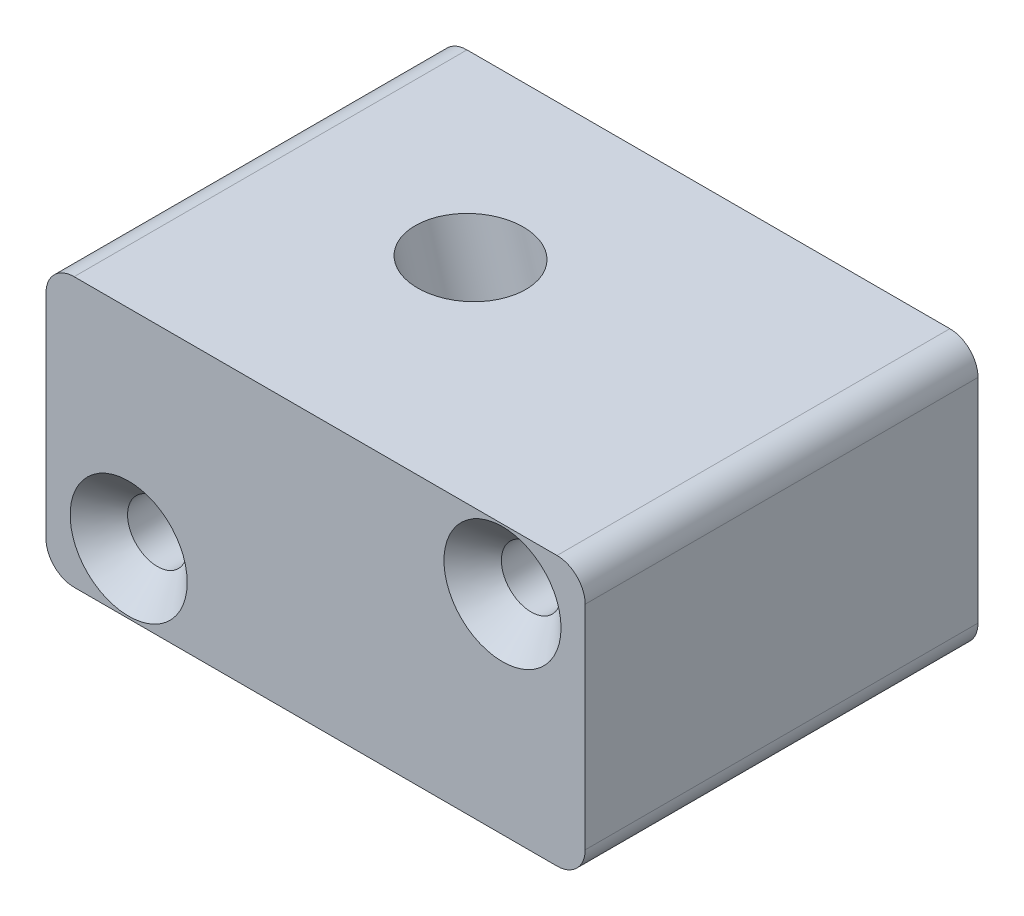
ISO-10303-21;
HEADER;
FILE_DESCRIPTION(('STEP AP214'),'2;1');
FILE_NAME('part.step','',(''),(''),'','','');
FILE_SCHEMA(('AUTOMOTIVE_DESIGN { 1 0 10303 214 1 1 1 1 }'));
ENDSEC;
DATA;
#1=APPLICATION_CONTEXT('core data for automotive mechanical design processes');
#2=APPLICATION_PROTOCOL_DEFINITION('international standard','automotive_design',2000,#1);
#3=PRODUCT_CONTEXT('',#1,'mechanical');
#4=PRODUCT('Part','Part','',(#3));
#5=PRODUCT_RELATED_PRODUCT_CATEGORY('part','',(#4));
#6=PRODUCT_DEFINITION_FORMATION('','',#4);
#7=PRODUCT_DEFINITION_CONTEXT('part definition',#1,'design');
#8=PRODUCT_DEFINITION('design','',#6,#7);
#9=PRODUCT_DEFINITION_SHAPE('','',#8);
#10=(LENGTH_UNIT() NAMED_UNIT(*) SI_UNIT(.MILLI.,.METRE.));
#11=(NAMED_UNIT(*) PLANE_ANGLE_UNIT() SI_UNIT($,.RADIAN.));
#12=(NAMED_UNIT(*) SI_UNIT($,.STERADIAN.) SOLID_ANGLE_UNIT());
#13=UNCERTAINTY_MEASURE_WITH_UNIT(LENGTH_MEASURE(1.E-05),#10,'distance_accuracy_value','');
#14=(GEOMETRIC_REPRESENTATION_CONTEXT(3) GLOBAL_UNCERTAINTY_ASSIGNED_CONTEXT((#13)) GLOBAL_UNIT_ASSIGNED_CONTEXT((#10,
#11,#12)) REPRESENTATION_CONTEXT('',''));
#15=CARTESIAN_POINT('',(0.,0.,0.));
#16=DIRECTION('',(0.,0.,1.));
#17=DIRECTION('',(1.,0.,0.));
#18=AXIS2_PLACEMENT_3D('',#15,#16,#17);
#19=CARTESIAN_POINT('',(-21.45,-9.45,17.45));
#20=DIRECTION('',(0.,0.,-1.));
#21=DIRECTION('',(-1.,0.,0.));
#22=AXIS2_PLACEMENT_3D('',#19,#20,#21);
#23=CYLINDRICAL_SURFACE('',#22,2.5);
#24=CARTESIAN_POINT('',(-21.45,-9.45,-17.45));
#25=DIRECTION('',(0.,0.,1.));
#26=DIRECTION('',(1.,0.,0.));
#27=AXIS2_PLACEMENT_3D('',#24,#25,#26);
#28=CIRCLE('',#27,2.5);
#29=CARTESIAN_POINT('',(-23.95,-9.45,-17.45));
#30=VERTEX_POINT('',#29);
#31=CARTESIAN_POINT('',(-21.45,-11.95,-17.45));
#32=VERTEX_POINT('',#31);
#33=EDGE_CURVE('E136',#30,#32,#28,.T.);
#34=ORIENTED_EDGE('',*,*,#33,.T.);
#35=DIRECTION('',(0.,0.,-1.));
#36=VECTOR('',#35,1.);
#37=CARTESIAN_POINT('',(-21.45,-11.95,17.45));
#38=LINE('',#37,#36);
#39=CARTESIAN_POINT('',(-21.45,-11.95,17.45));
#40=VERTEX_POINT('',#39);
#41=EDGE_CURVE('E11',#40,#32,#38,.T.);
#42=ORIENTED_EDGE('',*,*,#41,.F.);
#43=CARTESIAN_POINT('',(-21.45,-9.45,17.45));
#44=DIRECTION('',(0.,0.,1.));
#45=DIRECTION('',(1.,0.,0.));
#46=AXIS2_PLACEMENT_3D('',#43,#44,#45);
#47=CIRCLE('',#46,2.5);
#48=CARTESIAN_POINT('',(-23.95,-9.45,17.45));
#49=VERTEX_POINT('',#48);
#50=EDGE_CURVE('E151',#49,#40,#47,.T.);
#51=ORIENTED_EDGE('',*,*,#50,.F.);
#52=DIRECTION('',(0.,0.,-1.));
#53=VECTOR('',#52,1.);
#54=CARTESIAN_POINT('',(-23.95,-9.45,17.45));
#55=LINE('',#54,#53);
#56=EDGE_CURVE('E132',#49,#30,#55,.T.);
#57=ORIENTED_EDGE('',*,*,#56,.T.);
#58=EDGE_LOOP('',(#34,#42,#51,#57));
#59=FACE_BOUND('',#58,.T.);
#60=ADVANCED_FACE('F39',(#59),#23,.T.);
#61=CARTESIAN_POINT('',(-21.45,-11.95,17.45));
#62=DIRECTION('',(0.,1.,0.));
#63=DIRECTION('',(0.,0.,1.));
#64=AXIS2_PLACEMENT_3D('',#61,#62,#63);
#65=PLANE('',#64);
#66=CARTESIAN_POINT('',(1.99301451751905,-11.95,-1.63));
#67=DIRECTION('',(0.,1.,0.));
#68=DIRECTION('',(-1.,0.,0.));
#69=AXIS2_PLACEMENT_3D('',#66,#67,#68);
#70=ELLIPSE('',#69,4.91370556373311,4.699);
#71=CARTESIAN_POINT('',(-2.92069104621406,-11.95,-1.63));
#72=VERTEX_POINT('',#71);
#73=EDGE_CURVE('E202',#72,#72,#70,.F.);
#74=ORIENTED_EDGE('',*,*,#73,.F.);
#75=EDGE_LOOP('',(#74));
#76=FACE_BOUND('',#75,.T.);
#77=DIRECTION('',(1.,0.,0.));
#78=VECTOR('',#77,1.);
#79=CARTESIAN_POINT('',(-21.45,-11.95,-17.45));
#80=LINE('',#79,#78);
#81=CARTESIAN_POINT('',(21.45,-11.95,-17.45));
#82=VERTEX_POINT('',#81);
#83=EDGE_CURVE('E139',#32,#82,#80,.T.);
#84=ORIENTED_EDGE('',*,*,#83,.T.);
#85=DIRECTION('',(0.,0.,-1.));
#86=VECTOR('',#85,1.);
#87=CARTESIAN_POINT('',(21.45,-11.95,17.45));
#88=LINE('',#87,#86);
#89=CARTESIAN_POINT('',(21.45,-11.95,17.45));
#90=VERTEX_POINT('',#89);
#91=EDGE_CURVE('E48',#90,#82,#88,.T.);
#92=ORIENTED_EDGE('',*,*,#91,.F.);
#93=DIRECTION('',(1.,0.,0.));
#94=VECTOR('',#93,1.);
#95=CARTESIAN_POINT('',(-21.45,-11.95,17.45));
#96=LINE('',#95,#94);
#97=EDGE_CURVE('E99',#40,#90,#96,.T.);
#98=ORIENTED_EDGE('',*,*,#97,.F.);
#99=ORIENTED_EDGE('',*,*,#41,.T.);
#100=EDGE_LOOP('',(#84,#92,#98,#99));
#101=FACE_BOUND('',#100,.T.);
#102=ADVANCED_FACE('F223',(#76,#101),#65,.F.);
#103=CARTESIAN_POINT('',(21.45,-9.45,17.45));
#104=DIRECTION('',(0.,0.,-1.));
#105=DIRECTION('',(-1.,0.,0.));
#106=AXIS2_PLACEMENT_3D('',#103,#104,#105);
#107=CYLINDRICAL_SURFACE('',#106,2.5);
#108=CARTESIAN_POINT('',(21.45,-9.45,-17.45));
#109=DIRECTION('',(0.,0.,1.));
#110=DIRECTION('',(1.,0.,0.));
#111=AXIS2_PLACEMENT_3D('',#108,#109,#110);
#112=CIRCLE('',#111,2.5);
#113=CARTESIAN_POINT('',(23.95,-9.45,-17.45));
#114=VERTEX_POINT('',#113);
#115=EDGE_CURVE('E142',#82,#114,#112,.T.);
#116=ORIENTED_EDGE('',*,*,#115,.T.);
#117=DIRECTION('',(0.,0.,-1.));
#118=VECTOR('',#117,1.);
#119=CARTESIAN_POINT('',(23.95,-9.45,17.45));
#120=LINE('',#119,#118);
#121=CARTESIAN_POINT('',(23.95,-9.45,17.45));
#122=VERTEX_POINT('',#121);
#123=EDGE_CURVE('E158',#122,#114,#120,.T.);
#124=ORIENTED_EDGE('',*,*,#123,.F.);
#125=CARTESIAN_POINT('',(21.45,-9.45,17.45));
#126=DIRECTION('',(0.,0.,1.));
#127=DIRECTION('',(1.,0.,0.));
#128=AXIS2_PLACEMENT_3D('',#125,#126,#127);
#129=CIRCLE('',#128,2.5);
#130=EDGE_CURVE('E167',#90,#122,#129,.T.);
#131=ORIENTED_EDGE('',*,*,#130,.F.);
#132=ORIENTED_EDGE('',*,*,#91,.T.);
#133=EDGE_LOOP('',(#116,#124,#131,#132));
#134=FACE_BOUND('',#133,.T.);
#135=ADVANCED_FACE('F165',(#134),#107,.T.);
#136=CARTESIAN_POINT('',(23.95,-9.45,17.45));
#137=DIRECTION('',(-1.,0.,0.));
#138=DIRECTION('',(0.,0.,1.));
#139=AXIS2_PLACEMENT_3D('',#136,#137,#138);
#140=PLANE('',#139);
#141=DIRECTION('',(0.,1.,0.));
#142=VECTOR('',#141,1.);
#143=CARTESIAN_POINT('',(23.95,-9.45,-17.45));
#144=LINE('',#143,#142);
#145=CARTESIAN_POINT('',(23.95,9.45,-17.45));
#146=VERTEX_POINT('',#145);
#147=EDGE_CURVE('E144',#114,#146,#144,.T.);
#148=ORIENTED_EDGE('',*,*,#147,.T.);
#149=DIRECTION('',(0.,0.,-1.));
#150=VECTOR('',#149,1.);
#151=CARTESIAN_POINT('',(23.95,9.45,17.45));
#152=LINE('',#151,#150);
#153=CARTESIAN_POINT('',(23.95,9.45,17.45));
#154=VERTEX_POINT('',#153);
#155=EDGE_CURVE('E155',#154,#146,#152,.T.);
#156=ORIENTED_EDGE('',*,*,#155,.F.);
#157=DIRECTION('',(0.,1.,0.));
#158=VECTOR('',#157,1.);
#159=CARTESIAN_POINT('',(23.95,-9.45,17.45));
#160=LINE('',#159,#158);
#161=EDGE_CURVE('E179',#122,#154,#160,.T.);
#162=ORIENTED_EDGE('',*,*,#161,.F.);
#163=ORIENTED_EDGE('',*,*,#123,.T.);
#164=EDGE_LOOP('',(#148,#156,#162,#163));
#165=FACE_BOUND('',#164,.T.);
#166=ADVANCED_FACE('F175',(#165),#140,.F.);
#167=CARTESIAN_POINT('',(21.45,9.45,17.45));
#168=DIRECTION('',(0.,0.,-1.));
#169=DIRECTION('',(-1.,0.,0.));
#170=AXIS2_PLACEMENT_3D('',#167,#168,#169);
#171=CYLINDRICAL_SURFACE('',#170,2.5);
#172=CARTESIAN_POINT('',(21.45,9.45,-17.45));
#173=DIRECTION('',(0.,0.,1.));
#174=DIRECTION('',(1.,0.,0.));
#175=AXIS2_PLACEMENT_3D('',#172,#173,#174);
#176=CIRCLE('',#175,2.5);
#177=CARTESIAN_POINT('',(21.45,11.95,-17.45));
#178=VERTEX_POINT('',#177);
#179=EDGE_CURVE('E146',#146,#178,#176,.T.);
#180=ORIENTED_EDGE('',*,*,#179,.T.);
#181=DIRECTION('',(0.,0.,-1.));
#182=VECTOR('',#181,1.);
#183=CARTESIAN_POINT('',(21.45,11.95,17.45));
#184=LINE('',#183,#182);
#185=CARTESIAN_POINT('',(21.45,11.95,17.45));
#186=VERTEX_POINT('',#185);
#187=EDGE_CURVE('E127',#186,#178,#184,.T.);
#188=ORIENTED_EDGE('',*,*,#187,.F.);
#189=CARTESIAN_POINT('',(21.45,9.45,17.45));
#190=DIRECTION('',(0.,0.,1.));
#191=DIRECTION('',(1.,0.,0.));
#192=AXIS2_PLACEMENT_3D('',#189,#190,#191);
#193=CIRCLE('',#192,2.5);
#194=EDGE_CURVE('E118',#154,#186,#193,.T.);
#195=ORIENTED_EDGE('',*,*,#194,.F.);
#196=ORIENTED_EDGE('',*,*,#155,.T.);
#197=EDGE_LOOP('',(#180,#188,#195,#196));
#198=FACE_BOUND('',#197,.T.);
#199=ADVANCED_FACE('F178',(#198),#171,.T.);
#200=CARTESIAN_POINT('',(-21.45,11.95,17.45));
#201=DIRECTION('',(0.,-1.,0.));
#202=DIRECTION('',(0.,0.,-1.));
#203=AXIS2_PLACEMENT_3D('',#200,#201,#202);
#204=PLANE('',#203);
#205=CARTESIAN_POINT('',(-5.31394876934294,11.95,-1.63));
#206=DIRECTION('',(0.,-1.,0.));
#207=DIRECTION('',(-1.,0.,0.));
#208=AXIS2_PLACEMENT_3D('',#205,#206,#207);
#209=ELLIPSE('',#208,4.91370556373311,4.699);
#210=CARTESIAN_POINT('',(-10.2276543330761,11.95,-1.63));
#211=VERTEX_POINT('',#210);
#212=EDGE_CURVE('E42',#211,#211,#209,.F.);
#213=ORIENTED_EDGE('',*,*,#212,.F.);
#214=EDGE_LOOP('',(#213));
#215=FACE_BOUND('',#214,.T.);
#216=DIRECTION('',(-1.,0.,0.));
#217=VECTOR('',#216,1.);
#218=CARTESIAN_POINT('',(-21.45,11.95,-17.45));
#219=LINE('',#218,#217);
#220=CARTESIAN_POINT('',(-21.45,11.95,-17.45));
#221=VERTEX_POINT('',#220);
#222=EDGE_CURVE('E126',#178,#221,#219,.T.);
#223=ORIENTED_EDGE('',*,*,#222,.T.);
#224=DIRECTION('',(0.,0.,-1.));
#225=VECTOR('',#224,1.);
#226=CARTESIAN_POINT('',(-21.45,11.95,17.45));
#227=LINE('',#226,#225);
#228=CARTESIAN_POINT('',(-21.45,11.95,17.45));
#229=VERTEX_POINT('',#228);
#230=EDGE_CURVE('E123',#229,#221,#227,.T.);
#231=ORIENTED_EDGE('',*,*,#230,.F.);
#232=DIRECTION('',(-1.,0.,0.));
#233=VECTOR('',#232,1.);
#234=CARTESIAN_POINT('',(-21.45,11.95,17.45));
#235=LINE('',#234,#233);
#236=EDGE_CURVE('E112',#186,#229,#235,.T.);
#237=ORIENTED_EDGE('',*,*,#236,.F.);
#238=ORIENTED_EDGE('',*,*,#187,.T.);
#239=EDGE_LOOP('',(#223,#231,#237,#238));
#240=FACE_BOUND('',#239,.T.);
#241=ADVANCED_FACE('F124',(#215,#240),#204,.F.);
#242=CARTESIAN_POINT('',(-21.45,9.45,17.45));
#243=DIRECTION('',(0.,0.,-1.));
#244=DIRECTION('',(-1.,0.,0.));
#245=AXIS2_PLACEMENT_3D('',#242,#243,#244);
#246=CYLINDRICAL_SURFACE('',#245,2.5);
#247=CARTESIAN_POINT('',(-21.45,9.45,-17.45));
#248=DIRECTION('',(0.,0.,1.));
#249=DIRECTION('',(1.,0.,0.));
#250=AXIS2_PLACEMENT_3D('',#247,#248,#249);
#251=CIRCLE('',#250,2.5);
#252=CARTESIAN_POINT('',(-23.95,9.45,-17.45));
#253=VERTEX_POINT('',#252);
#254=EDGE_CURVE('E85',#221,#253,#251,.T.);
#255=ORIENTED_EDGE('',*,*,#254,.T.);
#256=DIRECTION('',(0.,0.,-1.));
#257=VECTOR('',#256,1.);
#258=CARTESIAN_POINT('',(-23.95,9.45,17.45));
#259=LINE('',#258,#257);
#260=CARTESIAN_POINT('',(-23.95,9.45,17.45));
#261=VERTEX_POINT('',#260);
#262=EDGE_CURVE('E128',#261,#253,#259,.T.);
#263=ORIENTED_EDGE('',*,*,#262,.F.);
#264=CARTESIAN_POINT('',(-21.45,9.45,17.45));
#265=DIRECTION('',(0.,0.,1.));
#266=DIRECTION('',(1.,0.,0.));
#267=AXIS2_PLACEMENT_3D('',#264,#265,#266);
#268=CIRCLE('',#267,2.5);
#269=EDGE_CURVE('E116',#229,#261,#268,.T.);
#270=ORIENTED_EDGE('',*,*,#269,.F.);
#271=ORIENTED_EDGE('',*,*,#230,.T.);
#272=EDGE_LOOP('',(#255,#263,#270,#271));
#273=FACE_BOUND('',#272,.T.);
#274=ADVANCED_FACE('F130',(#273),#246,.T.);
#275=CARTESIAN_POINT('',(-23.95,-9.45,17.45));
#276=DIRECTION('',(1.,0.,0.));
#277=DIRECTION('',(0.,0.,-1.));
#278=AXIS2_PLACEMENT_3D('',#275,#276,#277);
#279=PLANE('',#278);
#280=DIRECTION('',(0.,-1.,0.));
#281=VECTOR('',#280,1.);
#282=CARTESIAN_POINT('',(-23.95,-9.45,-17.45));
#283=LINE('',#282,#281);
#284=EDGE_CURVE('E91',#253,#30,#283,.T.);
#285=ORIENTED_EDGE('',*,*,#284,.T.);
#286=ORIENTED_EDGE('',*,*,#56,.F.);
#287=DIRECTION('',(0.,-1.,0.));
#288=VECTOR('',#287,1.);
#289=CARTESIAN_POINT('',(-23.95,-9.45,17.45));
#290=LINE('',#289,#288);
#291=EDGE_CURVE('E56',#261,#49,#290,.T.);
#292=ORIENTED_EDGE('',*,*,#291,.F.);
#293=ORIENTED_EDGE('',*,*,#262,.T.);
#294=EDGE_LOOP('',(#285,#286,#292,#293));
#295=FACE_BOUND('',#294,.T.);
#296=ADVANCED_FACE('F218',(#295),#279,.F.);
#297=CARTESIAN_POINT('',(-21.45,-9.45,17.45));
#298=DIRECTION('',(0.,0.,1.));
#299=DIRECTION('',(1.,0.,0.));
#300=AXIS2_PLACEMENT_3D('',#297,#298,#299);
#301=PLANE('',#300);
#302=CARTESIAN_POINT('',(-16.6053614054544,-6.55201107647365,17.45));
#303=DIRECTION('',(0.,0.,1.));
#304=DIRECTION('',(1.,0.,0.));
#305=AXIS2_PLACEMENT_3D('',#302,#303,#304);
#306=CIRCLE('',#305,5.2);
#307=CARTESIAN_POINT('',(-11.4053614054544,-6.55201107647365,17.45));
#308=VERTEX_POINT('',#307);
#309=EDGE_CURVE('E199',#308,#308,#306,.T.);
#310=ORIENTED_EDGE('',*,*,#309,.F.);
#311=EDGE_LOOP('',(#310));
#312=FACE_BOUND('',#311,.T.);
#313=CARTESIAN_POINT('',(16.6053614054544,6.55201107647364,17.45));
#314=DIRECTION('',(0.,0.,1.));
#315=DIRECTION('',(1.,0.,0.));
#316=AXIS2_PLACEMENT_3D('',#313,#314,#315);
#317=CIRCLE('',#316,5.2);
#318=CARTESIAN_POINT('',(21.8053614054544,6.55201107647364,17.45));
#319=VERTEX_POINT('',#318);
#320=EDGE_CURVE('E190',#319,#319,#317,.T.);
#321=ORIENTED_EDGE('',*,*,#320,.F.);
#322=EDGE_LOOP('',(#321));
#323=FACE_BOUND('',#322,.T.);
#324=ORIENTED_EDGE('',*,*,#50,.T.);
#325=ORIENTED_EDGE('',*,*,#97,.T.);
#326=ORIENTED_EDGE('',*,*,#130,.T.);
#327=ORIENTED_EDGE('',*,*,#161,.T.);
#328=ORIENTED_EDGE('',*,*,#194,.T.);
#329=ORIENTED_EDGE('',*,*,#236,.T.);
#330=ORIENTED_EDGE('',*,*,#269,.T.);
#331=ORIENTED_EDGE('',*,*,#291,.T.);
#332=EDGE_LOOP('',(#324,#325,#326,#327,#328,#329,#330,#331));
#333=FACE_BOUND('',#332,.T.);
#334=ADVANCED_FACE('F114',(#312,#323,#333),#301,.T.);
#335=CARTESIAN_POINT('',(-21.45,-9.45,-17.45));
#336=DIRECTION('',(0.,0.,1.));
#337=DIRECTION('',(1.,0.,0.));
#338=AXIS2_PLACEMENT_3D('',#335,#336,#337);
#339=PLANE('',#338);
#340=CARTESIAN_POINT('',(-16.6053614054544,-6.55201107647365,-17.45));
#341=DIRECTION('',(0.,0.,1.));
#342=DIRECTION('',(1.,0.,0.));
#343=AXIS2_PLACEMENT_3D('',#340,#341,#342);
#344=CIRCLE('',#343,2.64999999999998);
#345=CARTESIAN_POINT('',(-13.9553614054544,-6.55201107647365,-17.45));
#346=VERTEX_POINT('',#345);
#347=EDGE_CURVE('E193',#346,#346,#344,.T.);
#348=ORIENTED_EDGE('',*,*,#347,.T.);
#349=EDGE_LOOP('',(#348));
#350=FACE_BOUND('',#349,.T.);
#351=CARTESIAN_POINT('',(16.6053614054544,6.55201107647364,-17.45));
#352=DIRECTION('',(0.,0.,1.));
#353=DIRECTION('',(1.,0.,0.));
#354=AXIS2_PLACEMENT_3D('',#351,#352,#353);
#355=CIRCLE('',#354,2.64999999999998);
#356=CARTESIAN_POINT('',(19.2553614054544,6.55201107647364,-17.45));
#357=VERTEX_POINT('',#356);
#358=EDGE_CURVE('E140',#357,#357,#355,.T.);
#359=ORIENTED_EDGE('',*,*,#358,.T.);
#360=EDGE_LOOP('',(#359));
#361=FACE_BOUND('',#360,.T.);
#362=ORIENTED_EDGE('',*,*,#33,.F.);
#363=ORIENTED_EDGE('',*,*,#284,.F.);
#364=ORIENTED_EDGE('',*,*,#254,.F.);
#365=ORIENTED_EDGE('',*,*,#222,.F.);
#366=ORIENTED_EDGE('',*,*,#179,.F.);
#367=ORIENTED_EDGE('',*,*,#147,.F.);
#368=ORIENTED_EDGE('',*,*,#115,.F.);
#369=ORIENTED_EDGE('',*,*,#83,.F.);
#370=EDGE_LOOP('',(#362,#363,#364,#365,#366,#367,#368,#369));
#371=FACE_BOUND('',#370,.T.);
#372=ADVANCED_FACE('F171',(#350,#361,#371),#339,.F.);
#373=CARTESIAN_POINT('',(16.6053614054544,6.55201107647364,17.45));
#374=DIRECTION('',(0.,0.,1.));
#375=DIRECTION('',(1.,0.,0.));
#376=AXIS2_PLACEMENT_3D('',#373,#374,#375);
#377=CYLINDRICAL_SURFACE('',#376,2.64999999999999);
#378=ORIENTED_EDGE('',*,*,#358,.F.);
#379=EDGE_LOOP('',(#378));
#380=FACE_BOUND('',#379,.T.);
#381=CARTESIAN_POINT('',(16.6053614054544,6.55201107647364,14.9));
#382=DIRECTION('',(0.,0.,1.));
#383=DIRECTION('',(1.,0.,0.));
#384=AXIS2_PLACEMENT_3D('',#381,#382,#383);
#385=CIRCLE('',#384,2.65);
#386=CARTESIAN_POINT('',(19.2553614054544,6.55201107647364,14.9));
#387=VERTEX_POINT('',#386);
#388=EDGE_CURVE('E187',#387,#387,#385,.T.);
#389=ORIENTED_EDGE('',*,*,#388,.T.);
#390=EDGE_LOOP('',(#389));
#391=FACE_BOUND('',#390,.T.);
#392=ADVANCED_FACE('F240',(#380,#391),#377,.F.);
#393=CARTESIAN_POINT('',(16.6053614054544,6.55201107647364,17.45));
#394=DIRECTION('',(0.,0.,1.));
#395=DIRECTION('',(1.,0.,0.));
#396=AXIS2_PLACEMENT_3D('',#393,#394,#395);
#397=CONICAL_SURFACE('',#396,5.2,0.785398163397448);
#398=ORIENTED_EDGE('',*,*,#388,.F.);
#399=EDGE_LOOP('',(#398));
#400=FACE_BOUND('',#399,.T.);
#401=ORIENTED_EDGE('',*,*,#320,.T.);
#402=EDGE_LOOP('',(#401));
#403=FACE_BOUND('',#402,.T.);
#404=ADVANCED_FACE('F245',(#400,#403),#397,.F.);
#405=CARTESIAN_POINT('',(-16.6053614054544,-6.55201107647365,17.45));
#406=DIRECTION('',(0.,0.,1.));
#407=DIRECTION('',(1.,0.,0.));
#408=AXIS2_PLACEMENT_3D('',#405,#406,#407);
#409=CYLINDRICAL_SURFACE('',#408,2.64999999999999);
#410=ORIENTED_EDGE('',*,*,#347,.F.);
#411=EDGE_LOOP('',(#410));
#412=FACE_BOUND('',#411,.T.);
#413=CARTESIAN_POINT('',(-16.6053614054544,-6.55201107647365,14.9));
#414=DIRECTION('',(0.,0.,1.));
#415=DIRECTION('',(1.,0.,0.));
#416=AXIS2_PLACEMENT_3D('',#413,#414,#415);
#417=CIRCLE('',#416,2.65);
#418=CARTESIAN_POINT('',(-13.9553614054544,-6.55201107647365,14.9));
#419=VERTEX_POINT('',#418);
#420=EDGE_CURVE('E196',#419,#419,#417,.T.);
#421=ORIENTED_EDGE('',*,*,#420,.T.);
#422=EDGE_LOOP('',(#421));
#423=FACE_BOUND('',#422,.T.);
#424=ADVANCED_FACE('F249',(#412,#423),#409,.F.);
#425=CARTESIAN_POINT('',(-16.6053614054544,-6.55201107647365,17.45));
#426=DIRECTION('',(0.,0.,1.));
#427=DIRECTION('',(1.,0.,0.));
#428=AXIS2_PLACEMENT_3D('',#425,#426,#427);
#429=CONICAL_SURFACE('',#428,5.2,0.785398163397448);
#430=ORIENTED_EDGE('',*,*,#420,.F.);
#431=EDGE_LOOP('',(#430));
#432=FACE_BOUND('',#431,.T.);
#433=ORIENTED_EDGE('',*,*,#309,.T.);
#434=EDGE_LOOP('',(#433));
#435=FACE_BOUND('',#434,.T.);
#436=ADVANCED_FACE('F253',(#432,#435),#429,.F.);
#437=CARTESIAN_POINT('',(-7.88007630746551,20.3434249774324,-1.63));
#438=DIRECTION('',(-0.292371704722737,0.956304755963035,0.));
#439=DIRECTION('',(-0.956304755963035,-0.292371704722737,0.));
#440=AXIS2_PLACEMENT_3D('',#437,#438,#439);
#441=CYLINDRICAL_SURFACE('',#440,4.699);
#442=ORIENTED_EDGE('',*,*,#212,.T.);
#443=EDGE_LOOP('',(#442));
#444=FACE_BOUND('',#443,.T.);
#445=ORIENTED_EDGE('',*,*,#73,.T.);
#446=EDGE_LOOP('',(#445));
#447=FACE_BOUND('',#446,.T.);
#448=ADVANCED_FACE('F209',(#444,#447),#441,.F.);
#449=CLOSED_SHELL('',(#60,#102,#135,#166,#199,#241,#274,#296,#334,#372,#392,#404,#424,#436,#448));
#450=MANIFOLD_SOLID_BREP('B2',#449);
#451=ADVANCED_BREP_SHAPE_REPRESENTATION('',(#18,#450),#14);
#452=SHAPE_DEFINITION_REPRESENTATION(#9,#451);
ENDSEC;
END-ISO-10303-21;
